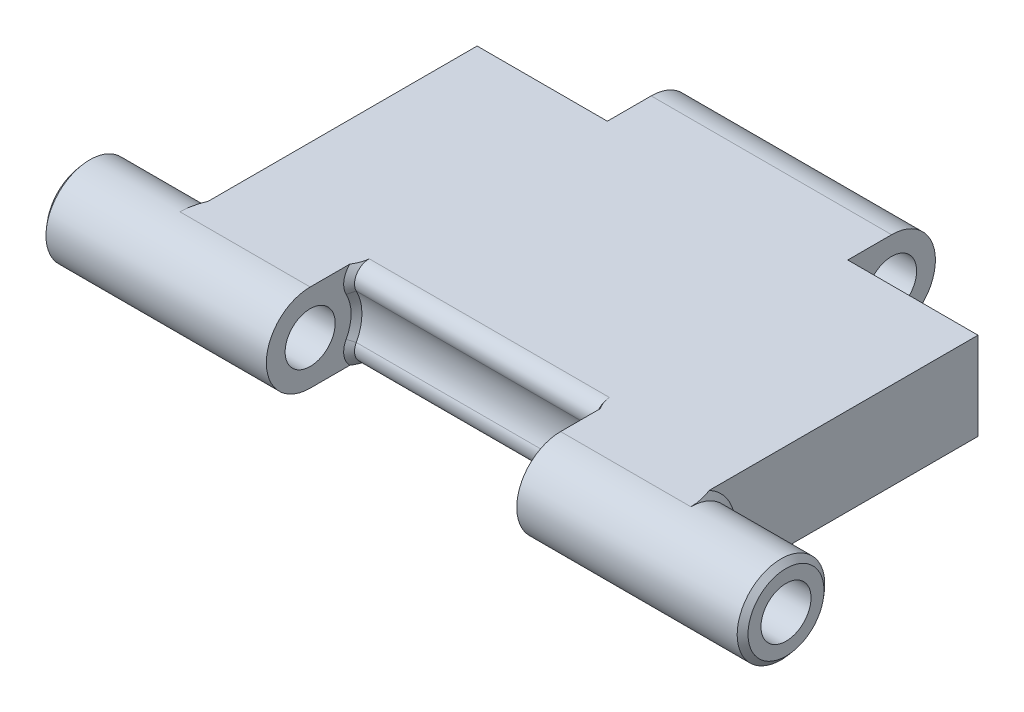
ISO-10303-21;
HEADER;
FILE_DESCRIPTION(('STEP AP214'),'2;1');
FILE_NAME('part.step','',(''),(''),'','','');
FILE_SCHEMA(('AUTOMOTIVE_DESIGN { 1 0 10303 214 1 1 1 1 }'));
ENDSEC;
DATA;
#1=APPLICATION_CONTEXT('core data for automotive mechanical design processes');
#2=APPLICATION_PROTOCOL_DEFINITION('international standard','automotive_design',2000,#1);
#3=PRODUCT_CONTEXT('',#1,'mechanical');
#4=PRODUCT('Part','Part','',(#3));
#5=PRODUCT_RELATED_PRODUCT_CATEGORY('part','',(#4));
#6=PRODUCT_DEFINITION_FORMATION('','',#4);
#7=PRODUCT_DEFINITION_CONTEXT('part definition',#1,'design');
#8=PRODUCT_DEFINITION('design','',#6,#7);
#9=PRODUCT_DEFINITION_SHAPE('','',#8);
#10=(LENGTH_UNIT() NAMED_UNIT(*) SI_UNIT(.MILLI.,.METRE.));
#11=(NAMED_UNIT(*) PLANE_ANGLE_UNIT() SI_UNIT($,.RADIAN.));
#12=(NAMED_UNIT(*) SI_UNIT($,.STERADIAN.) SOLID_ANGLE_UNIT());
#13=UNCERTAINTY_MEASURE_WITH_UNIT(LENGTH_MEASURE(1.E-05),#10,'distance_accuracy_value','');
#14=(GEOMETRIC_REPRESENTATION_CONTEXT(3) GLOBAL_UNCERTAINTY_ASSIGNED_CONTEXT((#13)) GLOBAL_UNIT_ASSIGNED_CONTEXT((#10,
#11,#12)) REPRESENTATION_CONTEXT('',''));
#15=CARTESIAN_POINT('',(0.,0.,0.));
#16=DIRECTION('',(0.,0.,1.));
#17=DIRECTION('',(1.,0.,0.));
#18=AXIS2_PLACEMENT_3D('',#15,#16,#17);
#19=CARTESIAN_POINT('',(-7.5,2.0625,-4.29679665744628));
#20=DIRECTION('',(0.,0.,1.));
#21=DIRECTION('',(1.,0.,0.));
#22=AXIS2_PLACEMENT_3D('',#19,#20,#21);
#23=PLANE('',#22);
#24=DIRECTION('',(0.,-1.,0.));
#25=VECTOR('',#24,1.);
#26=CARTESIAN_POINT('',(3.6,2.0625,-4.29679665744628));
#27=LINE('',#26,#25);
#28=CARTESIAN_POINT('',(3.6,2.0625,-4.29679665744628));
#29=VERTEX_POINT('',#28);
#30=CARTESIAN_POINT('',(3.6,-0.562500000000001,-4.29679665744628));
#31=VERTEX_POINT('',#30);
#32=EDGE_CURVE('E320',#29,#31,#27,.T.);
#33=ORIENTED_EDGE('',*,*,#32,.F.);
#34=DIRECTION('',(-1.,0.,0.));
#35=VECTOR('',#34,1.);
#36=CARTESIAN_POINT('',(-7.5,2.0625,-4.29679665744628));
#37=LINE('',#36,#35);
#38=CARTESIAN_POINT('',(7.50000000000001,2.0625,-4.29679665744628));
#39=VERTEX_POINT('',#38);
#40=EDGE_CURVE('E328',#39,#29,#37,.T.);
#41=ORIENTED_EDGE('',*,*,#40,.F.);
#42=DIRECTION('',(0.,-1.,0.));
#43=VECTOR('',#42,1.);
#44=CARTESIAN_POINT('',(7.50000000000001,2.0625,-4.29679665744628));
#45=LINE('',#44,#43);
#46=CARTESIAN_POINT('',(7.50000000000001,-0.562500000000001,-4.29679665744628));
#47=VERTEX_POINT('',#46);
#48=EDGE_CURVE('E337',#39,#47,#45,.T.);
#49=ORIENTED_EDGE('',*,*,#48,.T.);
#50=DIRECTION('',(-1.,0.,0.));
#51=VECTOR('',#50,1.);
#52=CARTESIAN_POINT('',(-7.5,-0.562500000000001,-4.29679665744628));
#53=LINE('',#52,#51);
#54=EDGE_CURVE('E341',#47,#31,#53,.T.);
#55=ORIENTED_EDGE('',*,*,#54,.T.);
#56=EDGE_LOOP('',(#33,#41,#49,#55));
#57=FACE_BOUND('',#56,.T.);
#58=ADVANCED_FACE('F37',(#57),#23,.F.);
#59=CARTESIAN_POINT('',(0.,2.0625,0.0782033425537235));
#60=DIRECTION('',(0.,1.,0.));
#61=DIRECTION('',(0.,0.,1.));
#62=AXIS2_PLACEMENT_3D('',#59,#60,#61);
#63=PLANE('',#62);
#64=DIRECTION('',(0.,0.,-1.));
#65=VECTOR('',#64,1.);
#66=CARTESIAN_POINT('',(-3.75,2.0625,0.0782033425537235));
#67=LINE('',#66,#65);
#68=CARTESIAN_POINT('',(-3.75,2.0625,4.45320334255372));
#69=VERTEX_POINT('',#68);
#70=CARTESIAN_POINT('',(-3.75,2.0625,3.26607283268659));
#71=VERTEX_POINT('',#70);
#72=EDGE_CURVE('E259',#69,#71,#67,.T.);
#73=ORIENTED_EDGE('',*,*,#72,.T.);
#74=CARTESIAN_POINT('',(-3.75,2.0625,3.26607283268659));
#75=CARTESIAN_POINT('',(-3.73472751691938,2.0625,3.24053395943589));
#76=CARTESIAN_POINT('',(-3.71988106027537,2.0625,3.21469278558408));
#77=CARTESIAN_POINT('',(-3.69156442785183,2.0625,3.16195463874504));
#78=CARTESIAN_POINT('',(-3.6781088066001,2.0625,3.13504992038088));
#79=CARTESIAN_POINT('',(-3.65387520853856,2.0625,3.08123408095706));
#80=CARTESIAN_POINT('',(-3.64301631062911,2.0625,3.05436034990466));
#81=CARTESIAN_POINT('',(-3.62437636089838,2.0625,2.99964098942122));
#82=CARTESIAN_POINT('',(-3.61658254316867,2.0625,2.97179992825206));
#83=CARTESIAN_POINT('',(-3.60736788235844,2.0625,2.92617061808718));
#84=CARTESIAN_POINT('',(-3.60464842548516,2.0625,2.90864678572411));
#85=CARTESIAN_POINT('',(-3.60094355449546,2.0625,2.87322739329477));
#86=CARTESIAN_POINT('',(-3.59997725733482,2.0625,2.85532986285039));
#87=CARTESIAN_POINT('',(-3.59999999999931,2.0625,2.83741212769966));
#88=B_SPLINE_CURVE_WITH_KNOTS('',3,(#74,#75,#76,#77,#78,#79,#80,#81,#82,#83,#84,#85,#86,#87),
.UNSPECIFIED.,.F.,.F.,(4,2,2,2,2,2,4),(0.,0.089330207665187,0.179516586136766,0.266351626059856,
0.352821071838593,0.405939062983331,0.459632864436187),.UNSPECIFIED.);
#89=CARTESIAN_POINT('',(-3.59999999999999,2.0625,2.83741212769953));
#90=VERTEX_POINT('',#89);
#91=EDGE_CURVE('E235',#71,#90,#88,.T.);
#92=ORIENTED_EDGE('',*,*,#91,.T.);
#93=DIRECTION('',(-1.,0.,0.));
#94=VECTOR('',#93,1.);
#95=CARTESIAN_POINT('',(3.75,2.0625,2.83741212769953));
#96=LINE('',#95,#94);
#97=CARTESIAN_POINT('',(3.6,2.0625,2.83741212769953));
#98=VERTEX_POINT('',#97);
#99=EDGE_CURVE('E217',#90,#98,#96,.F.);
#100=ORIENTED_EDGE('',*,*,#99,.T.);
#101=CARTESIAN_POINT('',(3.6,2.0625,2.83741212769953));
#102=CARTESIAN_POINT('',(3.59998598558496,2.0625,2.85287076891136));
#103=CARTESIAN_POINT('',(3.60070203770037,2.0625,2.86832071087352));
#104=CARTESIAN_POINT('',(3.60348290141405,2.0625,2.8990676080709));
#105=CARTESIAN_POINT('',(3.6055448904651,2.0625,2.91436481559499));
#106=CARTESIAN_POINT('',(3.61086650492335,2.0625,2.94450617756884));
#107=CARTESIAN_POINT('',(3.61410752058685,2.0625,2.95935368478284));
#108=CARTESIAN_POINT('',(3.62162944347252,2.0625,2.98878592876527));
#109=CARTESIAN_POINT('',(3.62591081784796,2.0625,3.00337054431811));
#110=CARTESIAN_POINT('',(3.63768570094887,2.0625,3.03941050382392));
#111=CARTESIAN_POINT('',(3.64571952778974,2.0625,3.06068851657887));
#112=CARTESIAN_POINT('',(3.6632496136343,2.0625,3.10264456338908));
#113=CARTESIAN_POINT('',(3.67274736452072,2.0625,3.12332195951883));
#114=CARTESIAN_POINT('',(3.69306241861763,2.0625,3.16464943573229));
#115=CARTESIAN_POINT('',(3.70390659471006,2.0625,3.18528613400107));
#116=CARTESIAN_POINT('',(3.72640786525296,2.0625,3.22603333105834));
#117=CARTESIAN_POINT('',(3.73806243434931,2.0625,3.24614521767035));
#118=CARTESIAN_POINT('',(3.75,2.0625,3.26607283268658));
#119=B_SPLINE_CURVE_WITH_KNOTS('',3,(#101,#102,#103,#104,#105,#106,#107,#108,#109,#110,#111,
#112,#113,#114,#115,#116,#117,#118),.UNSPECIFIED.,.F.,.F.,(4,2,2,2,2,2,2,2,4),(0.,
0.046345443506191,0.0925940074776784,0.138142189045309,0.183710861073522,0.251864569892143,
0.320088198965007,0.390002928340994,0.459708789489418),.UNSPECIFIED.);
#120=CARTESIAN_POINT('',(3.75,2.0625,3.26607283268658));
#121=VERTEX_POINT('',#120);
#122=EDGE_CURVE('E11',#98,#121,#119,.T.);
#123=ORIENTED_EDGE('',*,*,#122,.T.);
#124=DIRECTION('',(0.,0.,-1.));
#125=VECTOR('',#124,1.);
#126=CARTESIAN_POINT('',(3.75,2.0625,0.0782033425537235));
#127=LINE('',#126,#125);
#128=CARTESIAN_POINT('',(3.75,2.0625,4.45320334255372));
#129=VERTEX_POINT('',#128);
#130=EDGE_CURVE('E227',#129,#121,#127,.T.);
#131=ORIENTED_EDGE('',*,*,#130,.F.);
#132=DIRECTION('',(1.,0.,0.));
#133=VECTOR('',#132,1.);
#134=CARTESIAN_POINT('',(-7.49999999999999,2.0625,4.45320334255372));
#135=LINE('',#134,#133);
#136=CARTESIAN_POINT('',(7.65,2.0625,4.45320334255372));
#137=VERTEX_POINT('',#136);
#138=EDGE_CURVE('E163',#129,#137,#135,.T.);
#139=ORIENTED_EDGE('',*,*,#138,.T.);
#140=CARTESIAN_POINT('',(7.65,2.0625,4.45320334255372));
#141=CARTESIAN_POINT('',(7.65004182680005,2.0625,4.40690565201915));
#142=CARTESIAN_POINT('',(7.64790098279406,2.0625,4.36063343311652));
#143=CARTESIAN_POINT('',(7.63958444165527,2.0625,4.2685277521351));
#144=CARTESIAN_POINT('',(7.63341558535607,2.0625,4.22269367961116));
#145=CARTESIAN_POINT('',(7.61746979738847,2.0625,4.13225097953301));
#146=CARTESIAN_POINT('',(7.60773802670418,2.0625,4.08763421726658));
#147=CARTESIAN_POINT('',(7.58514662470327,2.0625,3.99920033076448));
#148=CARTESIAN_POINT('',(7.5722864589786,2.0625,3.95538334452681));
#149=CARTESIAN_POINT('',(7.54937471956883,2.0625,3.8852605242191));
#150=CARTESIAN_POINT('',(7.54013731473035,2.0625,3.85868317596236));
#151=CARTESIAN_POINT('',(7.52073374182946,2.0625,3.80575059493021));
#152=CARTESIAN_POINT('',(7.51056406772099,2.0625,3.77939664488737));
#153=CARTESIAN_POINT('',(7.50000000000002,2.0625,3.75320334255373));
#154=B_SPLINE_CURVE_WITH_KNOTS('',3,(#140,#141,#142,#143,#144,#145,#146,#147,#148,#149,#150,
#151,#152,#153),.UNSPECIFIED.,.F.,.F.,(4,2,2,2,2,2,4),(0.,0.138803058886172,0.277370997445077,
0.41424013900092,0.551132677664967,0.635529054686805,0.720256979095666),.UNSPECIFIED.);
#155=CARTESIAN_POINT('',(7.50000000000001,2.0625,3.75320334255373));
#156=VERTEX_POINT('',#155);
#157=EDGE_CURVE('E307',#137,#156,#154,.T.);
#158=ORIENTED_EDGE('',*,*,#157,.T.);
#159=DIRECTION('',(0.,0.,-1.));
#160=VECTOR('',#159,1.);
#161=CARTESIAN_POINT('',(7.50000000000001,2.0625,-4.29679665744628));
#162=LINE('',#161,#160);
#163=EDGE_CURVE('E192',#156,#39,#162,.T.);
#164=ORIENTED_EDGE('',*,*,#163,.T.);
#165=ORIENTED_EDGE('',*,*,#40,.T.);
#166=DIRECTION('',(0.,0.,1.));
#167=VECTOR('',#166,1.);
#168=CARTESIAN_POINT('',(3.6,2.0625,-5.60929665744627));
#169=LINE('',#168,#167);
#170=CARTESIAN_POINT('',(3.6,2.0625,-5.60929665744627));
#171=VERTEX_POINT('',#170);
#172=EDGE_CURVE('E317',#171,#29,#169,.T.);
#173=ORIENTED_EDGE('',*,*,#172,.F.);
#174=DIRECTION('',(-1.,0.,0.));
#175=VECTOR('',#174,1.);
#176=CARTESIAN_POINT('',(3.6,2.0625,-5.60929665744627));
#177=LINE('',#176,#175);
#178=CARTESIAN_POINT('',(-3.6,2.0625,-5.60929665744627));
#179=VERTEX_POINT('',#178);
#180=EDGE_CURVE('E228',#171,#179,#177,.T.);
#181=ORIENTED_EDGE('',*,*,#180,.T.);
#182=DIRECTION('',(0.,0.,1.));
#183=VECTOR('',#182,1.);
#184=CARTESIAN_POINT('',(-3.6,2.0625,-5.60929665744627));
#185=LINE('',#184,#183);
#186=CARTESIAN_POINT('',(-3.6,2.0625,-4.29679665744628));
#187=VERTEX_POINT('',#186);
#188=EDGE_CURVE('E325',#179,#187,#185,.T.);
#189=ORIENTED_EDGE('',*,*,#188,.T.);
#190=DIRECTION('',(-1.,0.,0.));
#191=VECTOR('',#190,1.);
#192=CARTESIAN_POINT('',(-7.5,2.0625,-4.29679665744628));
#193=LINE('',#192,#191);
#194=CARTESIAN_POINT('',(-7.5,2.0625,-4.29679665744628));
#195=VERTEX_POINT('',#194);
#196=EDGE_CURVE('E316',#187,#195,#193,.T.);
#197=ORIENTED_EDGE('',*,*,#196,.T.);
#198=DIRECTION('',(0.,0.,1.));
#199=VECTOR('',#198,1.);
#200=CARTESIAN_POINT('',(-7.5,2.0625,-4.29679665744628));
#201=LINE('',#200,#199);
#202=CARTESIAN_POINT('',(-7.49999999999999,2.0625,3.75320334255372));
#203=VERTEX_POINT('',#202);
#204=EDGE_CURVE('E282',#195,#203,#201,.T.);
#205=ORIENTED_EDGE('',*,*,#204,.T.);
#206=CARTESIAN_POINT('',(-7.49999999999999,2.0625,3.75320334255372));
#207=CARTESIAN_POINT('',(-7.52251586649166,2.0625,3.80903766150381));
#208=CARTESIAN_POINT('',(-7.54326947360992,2.0625,3.86567251460635));
#209=CARTESIAN_POINT('',(-7.57993834811692,2.0625,3.97988808309137));
#210=CARTESIAN_POINT('',(-7.59589706613527,2.0625,4.03745499156652));
#211=CARTESIAN_POINT('',(-7.62215127651204,2.0625,4.15404248360579));
#212=CARTESIAN_POINT('',(-7.63243564908112,2.0625,4.21306568633319));
#213=CARTESIAN_POINT('',(-7.64289049003036,2.0625,4.30244694472015));
#214=CARTESIAN_POINT('',(-7.64554740008557,2.0625,4.33252672610753));
#215=CARTESIAN_POINT('',(-7.64910565501946,2.0625,4.39280275178858));
#216=CARTESIAN_POINT('',(-7.65000622623105,2.0625,4.42299904153851));
#217=CARTESIAN_POINT('',(-7.64999999999999,2.0625,4.45320334255372));
#218=B_SPLINE_CURVE_WITH_KNOTS('',3,(#206,#207,#208,#209,#210,#211,#212,#213,#214,#215,#216,
#217),.UNSPECIFIED.,.F.,.F.,(4,2,2,2,2,4),(0.,0.180701723227069,0.35971280987811,
0.539073462653036,0.629618297139881,0.720203007616166),.UNSPECIFIED.);
#219=CARTESIAN_POINT('',(-7.64999999999999,2.0625,4.45320334255372));
#220=VERTEX_POINT('',#219);
#221=EDGE_CURVE('E203',#203,#220,#218,.T.);
#222=ORIENTED_EDGE('',*,*,#221,.T.);
#223=DIRECTION('',(1.,0.,0.));
#224=VECTOR('',#223,1.);
#225=CARTESIAN_POINT('',(-7.49999999999999,2.0625,4.45320334255372));
#226=LINE('',#225,#224);
#227=EDGE_CURVE('E208',#220,#69,#226,.T.);
#228=ORIENTED_EDGE('',*,*,#227,.T.);
#229=EDGE_LOOP('',(#73,#92,#100,#123,#131,#139,#158,#164,#165,#173,#181,#189,#197,#205,#222,#228));
#230=FACE_BOUND('',#229,.T.);
#231=ADVANCED_FACE('F284',(#230),#63,.T.);
#232=CARTESIAN_POINT('',(0.,-0.562500000000001,0.0782033425537235));
#233=DIRECTION('',(0.,1.,0.));
#234=DIRECTION('',(0.,0.,1.));
#235=AXIS2_PLACEMENT_3D('',#232,#233,#234);
#236=PLANE('',#235);
#237=DIRECTION('',(0.,0.,-1.));
#238=VECTOR('',#237,1.);
#239=CARTESIAN_POINT('',(3.75,-0.562500000000001,0.0782033425537235));
#240=LINE('',#239,#238);
#241=CARTESIAN_POINT('',(3.75,-0.562500000000001,4.45320334255372));
#242=VERTEX_POINT('',#241);
#243=CARTESIAN_POINT('',(3.75,-0.562500000000001,3.26607283268658));
#244=VERTEX_POINT('',#243);
#245=EDGE_CURVE('E112',#242,#244,#240,.T.);
#246=ORIENTED_EDGE('',*,*,#245,.T.);
#247=CARTESIAN_POINT('',(3.75,-0.562500000000001,3.26607283268658));
#248=CARTESIAN_POINT('',(3.73472751691939,-0.562500000000001,3.24053395943588));
#249=CARTESIAN_POINT('',(3.71988106027537,-0.562500000000001,3.21469278558407));
#250=CARTESIAN_POINT('',(3.69156442785184,-0.562500000000001,3.16195463874503));
#251=CARTESIAN_POINT('',(3.67810880660011,-0.562500000000001,3.13504992038087));
#252=CARTESIAN_POINT('',(3.65387520853856,-0.562500000000001,3.08123408095705));
#253=CARTESIAN_POINT('',(3.64301631062911,-0.562500000000001,3.05436034990465));
#254=CARTESIAN_POINT('',(3.62437636089838,-0.562500000000001,2.99964098942121));
#255=CARTESIAN_POINT('',(3.61658254316867,-0.562500000000001,2.97179992825205));
#256=CARTESIAN_POINT('',(3.60736788235845,-0.562500000000001,2.92617061808717));
#257=CARTESIAN_POINT('',(3.60464842548517,-0.562500000000001,2.9086467857241));
#258=CARTESIAN_POINT('',(3.60094355449547,-0.562500000000001,2.87322739329477));
#259=CARTESIAN_POINT('',(3.59997725733483,-0.562500000000001,2.85532986285039));
#260=CARTESIAN_POINT('',(3.59999999999932,-0.562500000000001,2.83741212769966));
#261=B_SPLINE_CURVE_WITH_KNOTS('',3,(#247,#248,#249,#250,#251,#252,#253,#254,#255,#256,#257,
#258,#259,#260),.UNSPECIFIED.,.F.,.F.,(4,2,2,2,2,2,4),(0.,0.089330207665187,0.179516586136765,
0.266351626059855,0.352821071838591,0.405939062983326,0.459632864436178),.UNSPECIFIED.);
#262=CARTESIAN_POINT('',(3.6,-0.562500000000001,2.83741212769953));
#263=VERTEX_POINT('',#262);
#264=EDGE_CURVE('E47',#244,#263,#261,.T.);
#265=ORIENTED_EDGE('',*,*,#264,.T.);
#266=DIRECTION('',(1.,0.,0.));
#267=VECTOR('',#266,1.);
#268=CARTESIAN_POINT('',(0.,-0.562500000000001,2.83741212769953));
#269=LINE('',#268,#267);
#270=CARTESIAN_POINT('',(-3.59999999999999,-0.562500000000001,2.83741212769953));
#271=VERTEX_POINT('',#270);
#272=EDGE_CURVE('E211',#263,#271,#269,.F.);
#273=ORIENTED_EDGE('',*,*,#272,.T.);
#274=CARTESIAN_POINT('',(-3.59999999999999,-0.562500000000001,2.83741212769953));
#275=CARTESIAN_POINT('',(-3.59998598558495,-0.562500000000001,2.85287076891136));
#276=CARTESIAN_POINT('',(-3.60070203770036,-0.562500000000001,2.86832071087352));
#277=CARTESIAN_POINT('',(-3.60348290141404,-0.562500000000001,2.8990676080709));
#278=CARTESIAN_POINT('',(-3.60554489046509,-0.562500000000001,2.91436481559499));
#279=CARTESIAN_POINT('',(-3.61086650492334,-0.562500000000001,2.94450617756884));
#280=CARTESIAN_POINT('',(-3.61410752058684,-0.562500000000001,2.95935368478284));
#281=CARTESIAN_POINT('',(-3.62162944347251,-0.562500000000001,2.98878592876528));
#282=CARTESIAN_POINT('',(-3.62591081784795,-0.562500000000001,3.00337054431811));
#283=CARTESIAN_POINT('',(-3.63768570094887,-0.562500000000001,3.03941050382392));
#284=CARTESIAN_POINT('',(-3.64571952778974,-0.562500000000001,3.06068851657887));
#285=CARTESIAN_POINT('',(-3.66324961363429,-0.562500000000001,3.10264456338909));
#286=CARTESIAN_POINT('',(-3.67274736452072,-0.562500000000001,3.12332195951884));
#287=CARTESIAN_POINT('',(-3.69306241861762,-0.562500000000001,3.1646494357323));
#288=CARTESIAN_POINT('',(-3.70390659471005,-0.562500000000001,3.18528613400107));
#289=CARTESIAN_POINT('',(-3.72640786525295,-0.562500000000001,3.22603333105835));
#290=CARTESIAN_POINT('',(-3.7380624343493,-0.562500000000001,3.24614521767036));
#291=CARTESIAN_POINT('',(-3.75,-0.562500000000001,3.26607283268659));
#292=B_SPLINE_CURVE_WITH_KNOTS('',3,(#274,#275,#276,#277,#278,#279,#280,#281,#282,#283,#284,
#285,#286,#287,#288,#289,#290,#291),.UNSPECIFIED.,.F.,.F.,(4,2,2,2,2,2,2,2,4),(0.,
0.0463454435061914,0.0925940074776793,0.138142189045311,0.183710861073525,0.251864569892147,
0.320088198965014,0.390002928341001,0.459708789489428),.UNSPECIFIED.);
#293=CARTESIAN_POINT('',(-3.75,-0.562500000000001,3.26607283268659));
#294=VERTEX_POINT('',#293);
#295=EDGE_CURVE('E253',#271,#294,#292,.T.);
#296=ORIENTED_EDGE('',*,*,#295,.T.);
#297=DIRECTION('',(0.,0.,-1.));
#298=VECTOR('',#297,1.);
#299=CARTESIAN_POINT('',(-3.75,-0.562500000000001,0.0782033425537235));
#300=LINE('',#299,#298);
#301=CARTESIAN_POINT('',(-3.75,-0.562500000000001,4.45320334255372));
#302=VERTEX_POINT('',#301);
#303=EDGE_CURVE('E188',#302,#294,#300,.T.);
#304=ORIENTED_EDGE('',*,*,#303,.F.);
#305=DIRECTION('',(1.,0.,0.));
#306=VECTOR('',#305,1.);
#307=CARTESIAN_POINT('',(-7.49999999999999,-0.562500000000001,4.45320334255372));
#308=LINE('',#307,#306);
#309=CARTESIAN_POINT('',(-7.64999999999999,-0.562500000000001,4.45320334255372));
#310=VERTEX_POINT('',#309);
#311=EDGE_CURVE('E181',#310,#302,#308,.T.);
#312=ORIENTED_EDGE('',*,*,#311,.F.);
#313=CARTESIAN_POINT('',(-7.64999999999999,-0.562500000000001,4.45320334255372));
#314=CARTESIAN_POINT('',(-7.65004182680004,-0.562500000000001,4.40690565201915));
#315=CARTESIAN_POINT('',(-7.64790098279405,-0.562500000000001,4.36063343311652));
#316=CARTESIAN_POINT('',(-7.63958444165526,-0.562500000000001,4.2685277521351));
#317=CARTESIAN_POINT('',(-7.63341558535606,-0.562500000000001,4.22269367961116));
#318=CARTESIAN_POINT('',(-7.61746979738845,-0.562500000000001,4.132250979533));
#319=CARTESIAN_POINT('',(-7.60773802670417,-0.562500000000001,4.08763421726658));
#320=CARTESIAN_POINT('',(-7.58514662470326,-0.562500000000001,3.99920033076448));
#321=CARTESIAN_POINT('',(-7.57228645897859,-0.562500000000001,3.9553833445268));
#322=CARTESIAN_POINT('',(-7.54937471956881,-0.562500000000001,3.88526052421909));
#323=CARTESIAN_POINT('',(-7.54013731473033,-0.562500000000001,3.85868317596235));
#324=CARTESIAN_POINT('',(-7.52073374182945,-0.562500000000001,3.8057505949302));
#325=CARTESIAN_POINT('',(-7.51056406772098,-0.562500000000001,3.77939664488736));
#326=CARTESIAN_POINT('',(-7.5,-0.562500000000001,3.75320334255372));
#327=B_SPLINE_CURVE_WITH_KNOTS('',3,(#313,#314,#315,#316,#317,#318,#319,#320,#321,#322,#323,
#324,#325,#326),.UNSPECIFIED.,.F.,.F.,(4,2,2,2,2,2,4),(0.,0.138803058886174,0.277370997445082,
0.414240139000925,0.551132677664973,0.635529054686815,0.720256979095677),.UNSPECIFIED.);
#328=CARTESIAN_POINT('',(-7.49999999999999,-0.562500000000001,3.75320334255372));
#329=VERTEX_POINT('',#328);
#330=EDGE_CURVE('E185',#310,#329,#327,.T.);
#331=ORIENTED_EDGE('',*,*,#330,.T.);
#332=DIRECTION('',(0.,0.,1.));
#333=VECTOR('',#332,1.);
#334=CARTESIAN_POINT('',(-7.5,-0.562500000000001,-4.29679665744628));
#335=LINE('',#334,#333);
#336=CARTESIAN_POINT('',(-7.5,-0.562500000000001,-4.29679665744628));
#337=VERTEX_POINT('',#336);
#338=EDGE_CURVE('E265',#337,#329,#335,.T.);
#339=ORIENTED_EDGE('',*,*,#338,.F.);
#340=DIRECTION('',(-1.,0.,0.));
#341=VECTOR('',#340,1.);
#342=CARTESIAN_POINT('',(-7.5,-0.562500000000001,-4.29679665744628));
#343=LINE('',#342,#341);
#344=CARTESIAN_POINT('',(-3.6,-0.562500000000001,-4.29679665744628));
#345=VERTEX_POINT('',#344);
#346=EDGE_CURVE('E343',#345,#337,#343,.T.);
#347=ORIENTED_EDGE('',*,*,#346,.F.);
#348=DIRECTION('',(0.,0.,-1.));
#349=VECTOR('',#348,1.);
#350=CARTESIAN_POINT('',(-3.6,-0.562500000000001,-4.29679665744628));
#351=LINE('',#350,#349);
#352=CARTESIAN_POINT('',(-3.6,-0.562500000000001,-5.60929665744629));
#353=VERTEX_POINT('',#352);
#354=EDGE_CURVE('E415',#345,#353,#351,.T.);
#355=ORIENTED_EDGE('',*,*,#354,.T.);
#356=DIRECTION('',(-1.,0.,0.));
#357=VECTOR('',#356,1.);
#358=CARTESIAN_POINT('',(3.6,-0.562500000000001,-5.60929665744629));
#359=LINE('',#358,#357);
#360=CARTESIAN_POINT('',(3.6,-0.562500000000001,-5.60929665744629));
#361=VERTEX_POINT('',#360);
#362=EDGE_CURVE('E324',#361,#353,#359,.T.);
#363=ORIENTED_EDGE('',*,*,#362,.F.);
#364=DIRECTION('',(0.,0.,-1.));
#365=VECTOR('',#364,1.);
#366=CARTESIAN_POINT('',(3.6,-0.562500000000001,-4.29679665744628));
#367=LINE('',#366,#365);
#368=EDGE_CURVE('E354',#31,#361,#367,.T.);
#369=ORIENTED_EDGE('',*,*,#368,.F.);
#370=ORIENTED_EDGE('',*,*,#54,.F.);
#371=DIRECTION('',(0.,0.,-1.));
#372=VECTOR('',#371,1.);
#373=CARTESIAN_POINT('',(7.50000000000001,-0.562500000000001,-4.29679665744628));
#374=LINE('',#373,#372);
#375=CARTESIAN_POINT('',(7.50000000000001,-0.562500000000001,3.75320334255373));
#376=VERTEX_POINT('',#375);
#377=EDGE_CURVE('E345',#376,#47,#374,.T.);
#378=ORIENTED_EDGE('',*,*,#377,.F.);
#379=CARTESIAN_POINT('',(7.50000000000001,-0.562500000000001,3.75320334255373));
#380=CARTESIAN_POINT('',(7.52251586649167,-0.562500000000001,3.80903766150382));
#381=CARTESIAN_POINT('',(7.54326947360993,-0.562500000000001,3.86567251460636));
#382=CARTESIAN_POINT('',(7.57993834811693,-0.562500000000001,3.97988808309138));
#383=CARTESIAN_POINT('',(7.59589706613528,-0.562500000000001,4.03745499156653));
#384=CARTESIAN_POINT('',(7.62215127651206,-0.562500000000001,4.15404248360579));
#385=CARTESIAN_POINT('',(7.63243564908113,-0.562500000000001,4.21306568633319));
#386=CARTESIAN_POINT('',(7.64289049003037,-0.562500000000001,4.30244694472015));
#387=CARTESIAN_POINT('',(7.64554740008558,-0.562500000000001,4.33252672610753));
#388=CARTESIAN_POINT('',(7.64910565501946,-0.562500000000001,4.39280275178858));
#389=CARTESIAN_POINT('',(7.65000622623106,-0.562500000000001,4.42299904153851));
#390=CARTESIAN_POINT('',(7.65,-0.562500000000001,4.45320334255372));
#391=B_SPLINE_CURVE_WITH_KNOTS('',3,(#379,#380,#381,#382,#383,#384,#385,#386,#387,#388,#389,
#390),.UNSPECIFIED.,.F.,.F.,(4,2,2,2,2,4),(0.,0.180701723227066,0.359712809878104,
0.539073462653026,0.629618297139869,0.720203007616154),.UNSPECIFIED.);
#392=CARTESIAN_POINT('',(7.65,-0.562500000000001,4.45320334255372));
#393=VERTEX_POINT('',#392);
#394=EDGE_CURVE('E204',#376,#393,#391,.T.);
#395=ORIENTED_EDGE('',*,*,#394,.T.);
#396=DIRECTION('',(1.,0.,0.));
#397=VECTOR('',#396,1.);
#398=CARTESIAN_POINT('',(-7.49999999999999,-0.562500000000001,4.45320334255372));
#399=LINE('',#398,#397);
#400=EDGE_CURVE('E193',#242,#393,#399,.T.);
#401=ORIENTED_EDGE('',*,*,#400,.F.);
#402=EDGE_LOOP('',(#246,#265,#273,#296,#304,#312,#331,#339,#347,#355,#363,#369,#370,#378,#395,#401));
#403=FACE_BOUND('',#402,.T.);
#404=ADVANCED_FACE('F183',(#403),#236,.F.);
#405=CARTESIAN_POINT('',(10.5,0.75,4.45320334255372));
#406=DIRECTION('',(-1.,0.,0.));
#407=DIRECTION('',(0.,0.,1.));
#408=AXIS2_PLACEMENT_3D('',#405,#406,#407);
#409=CYLINDRICAL_SURFACE('',#408,1.3125);
#410=CARTESIAN_POINT('',(-10.35,0.75,4.45320334255372));
#411=DIRECTION('',(1.,0.,0.));
#412=DIRECTION('',(0.,0.,-1.));
#413=AXIS2_PLACEMENT_3D('',#410,#411,#412);
#414=CIRCLE('',#413,1.3125);
#415=CARTESIAN_POINT('',(-10.35,0.75,3.14070334255372));
#416=VERTEX_POINT('',#415);
#417=EDGE_CURVE('E210',#416,#416,#414,.T.);
#418=ORIENTED_EDGE('',*,*,#417,.T.);
#419=EDGE_LOOP('',(#418));
#420=FACE_BOUND('',#419,.T.);
#421=CARTESIAN_POINT('',(-7.64999999999999,0.749999999999999,4.45320334255372));
#422=DIRECTION('',(-1.,0.,0.));
#423=DIRECTION('',(0.,0.,1.));
#424=AXIS2_PLACEMENT_3D('',#421,#422,#423);
#425=CIRCLE('',#424,1.3125);
#426=EDGE_CURVE('E200',#220,#310,#425,.T.);
#427=ORIENTED_EDGE('',*,*,#426,.T.);
#428=ORIENTED_EDGE('',*,*,#311,.T.);
#429=CARTESIAN_POINT('',(-3.75,0.749999999999999,4.45320334255372));
#430=DIRECTION('',(1.,0.,0.));
#431=DIRECTION('',(0.,0.,-1.));
#432=AXIS2_PLACEMENT_3D('',#429,#430,#431);
#433=CIRCLE('',#432,1.3125);
#434=EDGE_CURVE('E221',#69,#302,#433,.T.);
#435=ORIENTED_EDGE('',*,*,#434,.F.);
#436=ORIENTED_EDGE('',*,*,#227,.F.);
#437=EDGE_LOOP('',(#427,#428,#435,#436));
#438=FACE_BOUND('',#437,.T.);
#439=ADVANCED_FACE('F206',(#420,#438),#409,.T.);
#440=CARTESIAN_POINT('',(7.50000000000001,2.0625,-4.29679665744628));
#441=DIRECTION('',(-1.,0.,0.));
#442=DIRECTION('',(0.,0.,1.));
#443=AXIS2_PLACEMENT_3D('',#440,#441,#442);
#444=PLANE('',#443);
#445=ORIENTED_EDGE('',*,*,#163,.F.);
#446=CARTESIAN_POINT('',(7.50000000000001,0.749999999999998,4.45320334255372));
#447=DIRECTION('',(-1.,0.,0.));
#448=DIRECTION('',(0.,0.,1.));
#449=AXIS2_PLACEMENT_3D('',#446,#447,#448);
#450=CIRCLE('',#449,1.4875);
#451=EDGE_CURVE('E154',#156,#376,#450,.T.);
#452=ORIENTED_EDGE('',*,*,#451,.T.);
#453=ORIENTED_EDGE('',*,*,#377,.T.);
#454=ORIENTED_EDGE('',*,*,#48,.F.);
#455=EDGE_LOOP('',(#445,#452,#453,#454));
#456=FACE_BOUND('',#455,.T.);
#457=ADVANCED_FACE('F464',(#456),#444,.F.);
#458=ORIENTED_EDGE('',*,*,#196,.F.);
#459=DIRECTION('',(0.,-1.,0.));
#460=VECTOR('',#459,1.);
#461=CARTESIAN_POINT('',(-3.6,2.0625,-4.29679665744628));
#462=LINE('',#461,#460);
#463=EDGE_CURVE('E102',#187,#345,#462,.T.);
#464=ORIENTED_EDGE('',*,*,#463,.T.);
#465=ORIENTED_EDGE('',*,*,#346,.T.);
#466=DIRECTION('',(0.,-1.,0.));
#467=VECTOR('',#466,1.);
#468=CARTESIAN_POINT('',(-7.5,2.0625,-4.29679665744628));
#469=LINE('',#468,#467);
#470=EDGE_CURVE('E340',#195,#337,#469,.T.);
#471=ORIENTED_EDGE('',*,*,#470,.F.);
#472=EDGE_LOOP('',(#458,#464,#465,#471));
#473=FACE_BOUND('',#472,.T.);
#474=ADVANCED_FACE('F459',(#473),#23,.F.);
#475=CARTESIAN_POINT('',(-7.5,2.0625,-4.29679665744628));
#476=DIRECTION('',(1.,0.,0.));
#477=DIRECTION('',(0.,0.,-1.));
#478=AXIS2_PLACEMENT_3D('',#475,#476,#477);
#479=PLANE('',#478);
#480=ORIENTED_EDGE('',*,*,#338,.T.);
#481=CARTESIAN_POINT('',(-7.49999999999999,0.75,4.45320334255372));
#482=DIRECTION('',(1.,0.,0.));
#483=DIRECTION('',(0.,0.,-1.));
#484=AXIS2_PLACEMENT_3D('',#481,#482,#483);
#485=CIRCLE('',#484,1.4875);
#486=EDGE_CURVE('E202',#329,#203,#485,.T.);
#487=ORIENTED_EDGE('',*,*,#486,.T.);
#488=ORIENTED_EDGE('',*,*,#204,.F.);
#489=ORIENTED_EDGE('',*,*,#470,.T.);
#490=EDGE_LOOP('',(#480,#487,#488,#489));
#491=FACE_BOUND('',#490,.T.);
#492=ADVANCED_FACE('F463',(#491),#479,.F.);
#493=CARTESIAN_POINT('',(10.35,0.75,4.45320334255372));
#494=DIRECTION('',(-1.,0.,0.));
#495=DIRECTION('',(0.,0.,1.));
#496=AXIS2_PLACEMENT_3D('',#493,#494,#495);
#497=CIRCLE('',#496,1.3125);
#498=CARTESIAN_POINT('',(10.35,0.75,5.76570334255372));
#499=VERTEX_POINT('',#498);
#500=EDGE_CURVE('E364',#499,#499,#497,.T.);
#501=ORIENTED_EDGE('',*,*,#500,.T.);
#502=EDGE_LOOP('',(#501));
#503=FACE_BOUND('',#502,.T.);
#504=CARTESIAN_POINT('',(7.65,0.749999999999999,4.45320334255372));
#505=DIRECTION('',(1.,0.,0.));
#506=DIRECTION('',(0.,0.,-1.));
#507=AXIS2_PLACEMENT_3D('',#504,#505,#506);
#508=CIRCLE('',#507,1.3125);
#509=EDGE_CURVE('E365',#393,#137,#508,.T.);
#510=ORIENTED_EDGE('',*,*,#509,.T.);
#511=ORIENTED_EDGE('',*,*,#138,.F.);
#512=CARTESIAN_POINT('',(3.75,0.749999999999999,4.45320334255372));
#513=DIRECTION('',(1.,0.,0.));
#514=DIRECTION('',(0.,0.,-1.));
#515=AXIS2_PLACEMENT_3D('',#512,#513,#514);
#516=CIRCLE('',#515,1.3125);
#517=EDGE_CURVE('E225',#129,#242,#516,.T.);
#518=ORIENTED_EDGE('',*,*,#517,.T.);
#519=ORIENTED_EDGE('',*,*,#400,.T.);
#520=EDGE_LOOP('',(#510,#511,#518,#519));
#521=FACE_BOUND('',#520,.T.);
#522=ADVANCED_FACE('F469',(#503,#521),#409,.T.);
#523=CARTESIAN_POINT('',(10.5,0.749999999999999,4.45320334255372));
#524=DIRECTION('',(1.,0.,0.));
#525=DIRECTION('',(0.,0.,-1.));
#526=AXIS2_PLACEMENT_3D('',#523,#524,#525);
#527=PLANE('',#526);
#528=CARTESIAN_POINT('',(10.5,0.75,4.45320334255372));
#529=DIRECTION('',(1.,0.,0.));
#530=DIRECTION('',(0.,0.,-1.));
#531=AXIS2_PLACEMENT_3D('',#528,#529,#530);
#532=CIRCLE('',#531,0.75);
#533=CARTESIAN_POINT('',(10.5,0.75,3.70320334255372));
#534=VERTEX_POINT('',#533);
#535=EDGE_CURVE('E433',#534,#534,#532,.T.);
#536=ORIENTED_EDGE('',*,*,#535,.F.);
#537=EDGE_LOOP('',(#536));
#538=FACE_BOUND('',#537,.T.);
#539=CARTESIAN_POINT('',(10.5,0.75,4.45320334255372));
#540=DIRECTION('',(1.,0.,0.));
#541=DIRECTION('',(0.,0.,-1.));
#542=AXIS2_PLACEMENT_3D('',#539,#540,#541);
#543=CIRCLE('',#542,1.13750000000001);
#544=CARTESIAN_POINT('',(10.5,0.75,3.31570334255372));
#545=VERTEX_POINT('',#544);
#546=EDGE_CURVE('E368',#545,#545,#543,.T.);
#547=ORIENTED_EDGE('',*,*,#546,.T.);
#548=EDGE_LOOP('',(#547));
#549=FACE_BOUND('',#548,.T.);
#550=ADVANCED_FACE('F669',(#538,#549),#527,.T.);
#551=CARTESIAN_POINT('',(-10.5,0.749999999999999,4.45320334255372));
#552=DIRECTION('',(1.,0.,0.));
#553=DIRECTION('',(0.,0.,-1.));
#554=AXIS2_PLACEMENT_3D('',#551,#552,#553);
#555=PLANE('',#554);
#556=CARTESIAN_POINT('',(-10.5,0.75,4.45320334255372));
#557=DIRECTION('',(1.,0.,0.));
#558=DIRECTION('',(0.,0.,-1.));
#559=AXIS2_PLACEMENT_3D('',#556,#557,#558);
#560=CIRCLE('',#559,0.75);
#561=CARTESIAN_POINT('',(-10.5,0.75,3.70320334255372));
#562=VERTEX_POINT('',#561);
#563=EDGE_CURVE('E427',#562,#562,#560,.F.);
#564=ORIENTED_EDGE('',*,*,#563,.F.);
#565=EDGE_LOOP('',(#564));
#566=FACE_BOUND('',#565,.T.);
#567=CARTESIAN_POINT('',(-10.5,0.75,4.45320334255372));
#568=DIRECTION('',(-1.,0.,0.));
#569=DIRECTION('',(0.,-1.,0.));
#570=AXIS2_PLACEMENT_3D('',#567,#568,#569);
#571=CIRCLE('',#570,1.1375);
#572=CARTESIAN_POINT('',(-10.5,-0.3875,4.45320334255372));
#573=VERTEX_POINT('',#572);
#574=EDGE_CURVE('E214',#573,#573,#571,.T.);
#575=ORIENTED_EDGE('',*,*,#574,.T.);
#576=EDGE_LOOP('',(#575));
#577=FACE_BOUND('',#576,.T.);
#578=ADVANCED_FACE('F657',(#566,#577),#555,.F.);
#579=CARTESIAN_POINT('',(-3.75,0.75,4.45320334255372));
#580=DIRECTION('',(1.,0.,0.));
#581=DIRECTION('',(0.,0.,-1.));
#582=AXIS2_PLACEMENT_3D('',#579,#580,#581);
#583=CYLINDRICAL_SURFACE('',#582,1.4);
#584=DIRECTION('',(1.,0.,0.));
#585=VECTOR('',#584,1.);
#586=CARTESIAN_POINT('',(-3.75,1.41666666666667,3.22212432171243));
#587=LINE('',#586,#585);
#588=CARTESIAN_POINT('',(3.6,1.41666666666667,3.22212432171243));
#589=VERTEX_POINT('',#588);
#590=CARTESIAN_POINT('',(-3.59999999999999,1.41666666666667,3.22212432171243));
#591=VERTEX_POINT('',#590);
#592=EDGE_CURVE('E386',#589,#591,#587,.F.);
#593=ORIENTED_EDGE('',*,*,#592,.T.);
#594=CARTESIAN_POINT('',(-3.59999999999999,0.75,4.45320334255372));
#595=DIRECTION('',(-1.,0.,0.));
#596=DIRECTION('',(0.,0.,1.));
#597=AXIS2_PLACEMENT_3D('',#594,#595,#596);
#598=CIRCLE('',#597,1.4);
#599=CARTESIAN_POINT('',(-3.59999999999999,0.0833333333333328,3.22212432171243));
#600=VERTEX_POINT('',#599);
#601=EDGE_CURVE('E374',#591,#600,#598,.T.);
#602=ORIENTED_EDGE('',*,*,#601,.T.);
#603=DIRECTION('',(1.,0.,0.));
#604=VECTOR('',#603,1.);
#605=CARTESIAN_POINT('',(-3.75,0.0833333333333328,3.22212432171243));
#606=LINE('',#605,#604);
#607=CARTESIAN_POINT('',(3.6,0.0833333333333328,3.22212432171243));
#608=VERTEX_POINT('',#607);
#609=EDGE_CURVE('E224',#600,#608,#606,.T.);
#610=ORIENTED_EDGE('',*,*,#609,.T.);
#611=CARTESIAN_POINT('',(3.6,0.75,4.45320334255372));
#612=DIRECTION('',(1.,0.,0.));
#613=DIRECTION('',(0.,0.,-1.));
#614=AXIS2_PLACEMENT_3D('',#611,#612,#613);
#615=CIRCLE('',#614,1.4);
#616=EDGE_CURVE('E390',#608,#589,#615,.T.);
#617=ORIENTED_EDGE('',*,*,#616,.T.);
#618=EDGE_LOOP('',(#593,#602,#610,#617));
#619=FACE_BOUND('',#618,.T.);
#620=ADVANCED_FACE('F539',(#619),#583,.F.);
#621=CARTESIAN_POINT('',(-3.75,0.749999999999999,4.45320334255372));
#622=DIRECTION('',(1.,0.,0.));
#623=DIRECTION('',(0.,0.,-1.));
#624=AXIS2_PLACEMENT_3D('',#621,#622,#623);
#625=PLANE('',#624);
#626=CARTESIAN_POINT('',(-3.75,0.75,4.45320334255372));
#627=DIRECTION('',(1.,0.,0.));
#628=DIRECTION('',(0.,0.,-1.));
#629=AXIS2_PLACEMENT_3D('',#626,#627,#628);
#630=CIRCLE('',#629,0.75);
#631=CARTESIAN_POINT('',(-3.75,0.75,3.70320334255372));
#632=VERTEX_POINT('',#631);
#633=EDGE_CURVE('E411',#632,#632,#630,.T.);
#634=ORIENTED_EDGE('',*,*,#633,.F.);
#635=EDGE_LOOP('',(#634));
#636=FACE_BOUND('',#635,.T.);
#637=ORIENTED_EDGE('',*,*,#303,.T.);
#638=CARTESIAN_POINT('',(-3.74999999999999,-0.125000000000001,2.83741212769953));
#639=DIRECTION('',(-1.,0.,0.));
#640=DIRECTION('',(0.,0.,1.));
#641=AXIS2_PLACEMENT_3D('',#638,#639,#640);
#642=CIRCLE('',#641,0.612500000000006);
#643=CARTESIAN_POINT('',(-3.75,0.16666666666667,3.3760091993176));
#644=VERTEX_POINT('',#643);
#645=EDGE_CURVE('E397',#294,#644,#642,.T.);
#646=ORIENTED_EDGE('',*,*,#645,.T.);
#647=CARTESIAN_POINT('',(-3.74999999999999,0.749999999999999,4.45320334255372));
#648=DIRECTION('',(1.,0.,0.));
#649=DIRECTION('',(0.,0.,-1.));
#650=AXIS2_PLACEMENT_3D('',#647,#648,#649);
#651=CIRCLE('',#650,1.22499999999999);
#652=CARTESIAN_POINT('',(-3.75,1.33333333333333,3.3760091993176));
#653=VERTEX_POINT('',#652);
#654=EDGE_CURVE('E398',#644,#653,#651,.T.);
#655=ORIENTED_EDGE('',*,*,#654,.T.);
#656=CARTESIAN_POINT('',(-3.75,1.625,2.83741212769953));
#657=DIRECTION('',(-1.,0.,0.));
#658=DIRECTION('',(0.,0.,1.));
#659=AXIS2_PLACEMENT_3D('',#656,#657,#658);
#660=CIRCLE('',#659,0.612500000000007);
#661=EDGE_CURVE('E395',#653,#71,#660,.T.);
#662=ORIENTED_EDGE('',*,*,#661,.T.);
#663=ORIENTED_EDGE('',*,*,#72,.F.);
#664=ORIENTED_EDGE('',*,*,#434,.T.);
#665=EDGE_LOOP('',(#637,#646,#655,#662,#663,#664));
#666=FACE_BOUND('',#665,.T.);
#667=ADVANCED_FACE('F518',(#636,#666),#625,.T.);
#668=CARTESIAN_POINT('',(3.75,0.749999999999999,4.45320334255372));
#669=DIRECTION('',(1.,0.,0.));
#670=DIRECTION('',(0.,0.,-1.));
#671=AXIS2_PLACEMENT_3D('',#668,#669,#670);
#672=PLANE('',#671);
#673=CARTESIAN_POINT('',(3.75,0.75,4.45320334255372));
#674=DIRECTION('',(1.,0.,0.));
#675=DIRECTION('',(0.,0.,-1.));
#676=AXIS2_PLACEMENT_3D('',#673,#674,#675);
#677=CIRCLE('',#676,0.75);
#678=CARTESIAN_POINT('',(3.75,0.75,3.70320334255372));
#679=VERTEX_POINT('',#678);
#680=EDGE_CURVE('E41',#679,#679,#677,.T.);
#681=ORIENTED_EDGE('',*,*,#680,.T.);
#682=EDGE_LOOP('',(#681));
#683=FACE_BOUND('',#682,.T.);
#684=CARTESIAN_POINT('',(3.75,0.749999999999999,4.45320334255372));
#685=DIRECTION('',(-1.,0.,0.));
#686=DIRECTION('',(0.,0.,1.));
#687=AXIS2_PLACEMENT_3D('',#684,#685,#686);
#688=CIRCLE('',#687,1.225);
#689=CARTESIAN_POINT('',(3.75,1.33333333333333,3.37600919931759));
#690=VERTEX_POINT('',#689);
#691=CARTESIAN_POINT('',(3.75,0.166666666666667,3.37600919931759));
#692=VERTEX_POINT('',#691);
#693=EDGE_CURVE('E56',#690,#692,#688,.T.);
#694=ORIENTED_EDGE('',*,*,#693,.T.);
#695=CARTESIAN_POINT('',(3.75,-0.125000000000001,2.83741212769953));
#696=DIRECTION('',(1.,0.,0.));
#697=DIRECTION('',(0.,0.,-1.));
#698=AXIS2_PLACEMENT_3D('',#695,#696,#697);
#699=CIRCLE('',#698,0.6125);
#700=EDGE_CURVE('E314',#692,#244,#699,.T.);
#701=ORIENTED_EDGE('',*,*,#700,.T.);
#702=ORIENTED_EDGE('',*,*,#245,.F.);
#703=ORIENTED_EDGE('',*,*,#517,.F.);
#704=ORIENTED_EDGE('',*,*,#130,.T.);
#705=CARTESIAN_POINT('',(3.75,1.625,2.83741212769953));
#706=DIRECTION('',(1.,0.,0.));
#707=DIRECTION('',(0.,0.,-1.));
#708=AXIS2_PLACEMENT_3D('',#705,#706,#707);
#709=CIRCLE('',#708,0.6125);
#710=EDGE_CURVE('E373',#121,#690,#709,.T.);
#711=ORIENTED_EDGE('',*,*,#710,.T.);
#712=EDGE_LOOP('',(#694,#701,#702,#703,#704,#711));
#713=FACE_BOUND('',#712,.T.);
#714=ADVANCED_FACE('F445',(#683,#713),#672,.F.);
#715=CARTESIAN_POINT('',(-3.75,1.625,2.83741212769953));
#716=DIRECTION('',(1.,0.,0.));
#717=DIRECTION('',(0.,0.,-1.));
#718=AXIS2_PLACEMENT_3D('',#715,#716,#717);
#719=CYLINDRICAL_SURFACE('',#718,0.4375);
#720=ORIENTED_EDGE('',*,*,#99,.F.);
#721=CARTESIAN_POINT('',(-3.59999999999999,1.625,2.83741212769953));
#722=DIRECTION('',(1.,0.,0.));
#723=DIRECTION('',(0.,0.,-1.));
#724=AXIS2_PLACEMENT_3D('',#721,#722,#723);
#725=CIRCLE('',#724,0.4375);
#726=EDGE_CURVE('E379',#90,#591,#725,.T.);
#727=ORIENTED_EDGE('',*,*,#726,.T.);
#728=ORIENTED_EDGE('',*,*,#592,.F.);
#729=CARTESIAN_POINT('',(3.6,1.625,2.83741212769953));
#730=DIRECTION('',(-1.,0.,0.));
#731=DIRECTION('',(0.,0.,1.));
#732=AXIS2_PLACEMENT_3D('',#729,#730,#731);
#733=CIRCLE('',#732,0.4375);
#734=EDGE_CURVE('E377',#589,#98,#733,.T.);
#735=ORIENTED_EDGE('',*,*,#734,.T.);
#736=EDGE_LOOP('',(#720,#727,#728,#735));
#737=FACE_BOUND('',#736,.T.);
#738=ADVANCED_FACE('F531',(#737),#719,.T.);
#739=CARTESIAN_POINT('',(-3.75,-0.125000000000001,2.83741212769953));
#740=DIRECTION('',(1.,0.,0.));
#741=DIRECTION('',(0.,0.,-1.));
#742=AXIS2_PLACEMENT_3D('',#739,#740,#741);
#743=CYLINDRICAL_SURFACE('',#742,0.4375);
#744=ORIENTED_EDGE('',*,*,#609,.F.);
#745=CARTESIAN_POINT('',(-3.59999999999999,-0.125000000000001,2.83741212769953));
#746=DIRECTION('',(1.,0.,0.));
#747=DIRECTION('',(0.,0.,-1.));
#748=AXIS2_PLACEMENT_3D('',#745,#746,#747);
#749=CIRCLE('',#748,0.4375);
#750=EDGE_CURVE('E380',#600,#271,#749,.T.);
#751=ORIENTED_EDGE('',*,*,#750,.T.);
#752=ORIENTED_EDGE('',*,*,#272,.F.);
#753=CARTESIAN_POINT('',(3.6,-0.125000000000001,2.83741212769953));
#754=DIRECTION('',(-1.,0.,0.));
#755=DIRECTION('',(0.,0.,1.));
#756=AXIS2_PLACEMENT_3D('',#753,#754,#755);
#757=CIRCLE('',#756,0.4375);
#758=EDGE_CURVE('E404',#263,#608,#757,.T.);
#759=ORIENTED_EDGE('',*,*,#758,.T.);
#760=EDGE_LOOP('',(#744,#751,#752,#759));
#761=FACE_BOUND('',#760,.T.);
#762=ADVANCED_FACE('F526',(#761),#743,.T.);
#763=CARTESIAN_POINT('',(3.6,0.749999999999999,-5.60929665744628));
#764=DIRECTION('',(1.,0.,0.));
#765=DIRECTION('',(0.,0.,-1.));
#766=AXIS2_PLACEMENT_3D('',#763,#764,#765);
#767=PLANE('',#766);
#768=CARTESIAN_POINT('',(3.6,0.749999999999999,-5.60929665744628));
#769=DIRECTION('',(1.,0.,0.));
#770=DIRECTION('',(0.,0.,-1.));
#771=AXIS2_PLACEMENT_3D('',#768,#769,#770);
#772=CIRCLE('',#771,0.75);
#773=CARTESIAN_POINT('',(3.6,0.749999999999999,-6.35929665744628));
#774=VERTEX_POINT('',#773);
#775=EDGE_CURVE('E426',#774,#774,#772,.T.);
#776=ORIENTED_EDGE('',*,*,#775,.F.);
#777=EDGE_LOOP('',(#776));
#778=FACE_BOUND('',#777,.T.);
#779=CARTESIAN_POINT('',(3.6,0.749999999999999,-5.60929665744628));
#780=DIRECTION('',(1.,0.,0.));
#781=DIRECTION('',(0.,0.,-1.));
#782=AXIS2_PLACEMENT_3D('',#779,#780,#781);
#783=CIRCLE('',#782,1.3125);
#784=EDGE_CURVE('E321',#361,#171,#783,.T.);
#785=ORIENTED_EDGE('',*,*,#784,.T.);
#786=ORIENTED_EDGE('',*,*,#172,.T.);
#787=ORIENTED_EDGE('',*,*,#32,.T.);
#788=ORIENTED_EDGE('',*,*,#368,.T.);
#789=EDGE_LOOP('',(#785,#786,#787,#788));
#790=FACE_BOUND('',#789,.T.);
#791=ADVANCED_FACE('F487',(#778,#790),#767,.T.);
#792=CARTESIAN_POINT('',(-3.6,0.749999999999999,-5.60929665744628));
#793=DIRECTION('',(1.,0.,0.));
#794=DIRECTION('',(0.,0.,-1.));
#795=AXIS2_PLACEMENT_3D('',#792,#793,#794);
#796=PLANE('',#795);
#797=CARTESIAN_POINT('',(-3.6,0.749999999999999,-5.60929665744628));
#798=DIRECTION('',(1.,0.,0.));
#799=DIRECTION('',(0.,0.,-1.));
#800=AXIS2_PLACEMENT_3D('',#797,#798,#799);
#801=CIRCLE('',#800,0.75);
#802=CARTESIAN_POINT('',(-3.6,0.749999999999999,-6.35929665744628));
#803=VERTEX_POINT('',#802);
#804=EDGE_CURVE('E424',#803,#803,#801,.T.);
#805=ORIENTED_EDGE('',*,*,#804,.T.);
#806=EDGE_LOOP('',(#805));
#807=FACE_BOUND('',#806,.T.);
#808=CARTESIAN_POINT('',(-3.6,0.749999999999999,-5.60929665744628));
#809=DIRECTION('',(1.,0.,0.));
#810=DIRECTION('',(0.,0.,-1.));
#811=AXIS2_PLACEMENT_3D('',#808,#809,#810);
#812=CIRCLE('',#811,1.3125);
#813=EDGE_CURVE('E327',#353,#179,#812,.T.);
#814=ORIENTED_EDGE('',*,*,#813,.F.);
#815=ORIENTED_EDGE('',*,*,#354,.F.);
#816=ORIENTED_EDGE('',*,*,#463,.F.);
#817=ORIENTED_EDGE('',*,*,#188,.F.);
#818=EDGE_LOOP('',(#814,#815,#816,#817));
#819=FACE_BOUND('',#818,.T.);
#820=ADVANCED_FACE('F478',(#807,#819),#796,.F.);
#821=CARTESIAN_POINT('',(3.6,0.75,-5.60929665744628));
#822=DIRECTION('',(-1.,0.,0.));
#823=DIRECTION('',(0.,-1.,0.));
#824=AXIS2_PLACEMENT_3D('',#821,#822,#823);
#825=CYLINDRICAL_SURFACE('',#824,1.3125);
#826=ORIENTED_EDGE('',*,*,#813,.T.);
#827=ORIENTED_EDGE('',*,*,#180,.F.);
#828=ORIENTED_EDGE('',*,*,#784,.F.);
#829=ORIENTED_EDGE('',*,*,#362,.T.);
#830=EDGE_LOOP('',(#826,#827,#828,#829));
#831=FACE_BOUND('',#830,.T.);
#832=ADVANCED_FACE('F489',(#831),#825,.T.);
#833=CARTESIAN_POINT('',(-10.35,0.749999999999999,4.45320334255372));
#834=DIRECTION('',(1.,0.,0.));
#835=DIRECTION('',(0.,1.,0.));
#836=AXIS2_PLACEMENT_3D('',#833,#834,#835);
#837=CONICAL_SURFACE('',#836,1.3125,0.862170054667221);
#838=ORIENTED_EDGE('',*,*,#574,.F.);
#839=EDGE_LOOP('',(#838));
#840=FACE_BOUND('',#839,.T.);
#841=ORIENTED_EDGE('',*,*,#417,.F.);
#842=EDGE_LOOP('',(#841));
#843=FACE_BOUND('',#842,.T.);
#844=ADVANCED_FACE('F491',(#840,#843),#837,.T.);
#845=CARTESIAN_POINT('',(10.35,0.749999999999999,4.45320334255372));
#846=DIRECTION('',(-1.,0.,0.));
#847=DIRECTION('',(0.,-1.,0.));
#848=AXIS2_PLACEMENT_3D('',#845,#846,#847);
#849=CONICAL_SURFACE('',#848,1.3125,0.862170054667222);
#850=ORIENTED_EDGE('',*,*,#500,.F.);
#851=EDGE_LOOP('',(#850));
#852=FACE_BOUND('',#851,.T.);
#853=ORIENTED_EDGE('',*,*,#546,.F.);
#854=EDGE_LOOP('',(#853));
#855=FACE_BOUND('',#854,.T.);
#856=ADVANCED_FACE('F497',(#852,#855),#849,.T.);
#857=CARTESIAN_POINT('',(7.50000000000001,0.749999999999999,4.45320334255372));
#858=DIRECTION('',(-1.,0.,0.));
#859=DIRECTION('',(0.,0.,1.));
#860=AXIS2_PLACEMENT_3D('',#857,#858,#859);
#861=CONICAL_SURFACE('',#860,1.4875,0.862170054667219);
#862=ORIENTED_EDGE('',*,*,#394,.F.);
#863=ORIENTED_EDGE('',*,*,#451,.F.);
#864=ORIENTED_EDGE('',*,*,#157,.F.);
#865=ORIENTED_EDGE('',*,*,#509,.F.);
#866=EDGE_LOOP('',(#862,#863,#864,#865));
#867=FACE_BOUND('',#866,.T.);
#868=ADVANCED_FACE('F271',(#867),#861,.T.);
#869=CARTESIAN_POINT('',(-7.4999999999999,0.749999999999999,4.45320334255372));
#870=DIRECTION('',(1.,0.,0.));
#871=DIRECTION('',(0.,0.,-1.));
#872=AXIS2_PLACEMENT_3D('',#869,#870,#871);
#873=CONICAL_SURFACE('',#872,1.48750000000011,0.862170054667227);
#874=ORIENTED_EDGE('',*,*,#221,.F.);
#875=ORIENTED_EDGE('',*,*,#486,.F.);
#876=ORIENTED_EDGE('',*,*,#330,.F.);
#877=ORIENTED_EDGE('',*,*,#426,.F.);
#878=EDGE_LOOP('',(#874,#875,#876,#877));
#879=FACE_BOUND('',#878,.T.);
#880=ADVANCED_FACE('F199',(#879),#873,.T.);
#881=CARTESIAN_POINT('',(-3.75,1.625,2.83741212769953));
#882=DIRECTION('',(-1.,0.,0.));
#883=DIRECTION('',(0.,-1.,0.));
#884=AXIS2_PLACEMENT_3D('',#881,#882,#883);
#885=CONICAL_SURFACE('',#884,0.612500000000008,0.862170054667231);
#886=ORIENTED_EDGE('',*,*,#91,.F.);
#887=ORIENTED_EDGE('',*,*,#661,.F.);
#888=DIRECTION('',(-0.650791373455965,-0.361550763031096,0.667646339005113));
#889=VECTOR('',#888,1.);
#890=CARTESIAN_POINT('',(-3.59999999999999,1.41666666666667,3.22212432171243));
#891=LINE('',#890,#889);
#892=EDGE_CURVE('E399',#591,#653,#891,.T.);
#893=ORIENTED_EDGE('',*,*,#892,.F.);
#894=ORIENTED_EDGE('',*,*,#726,.F.);
#895=EDGE_LOOP('',(#886,#887,#893,#894));
#896=FACE_BOUND('',#895,.T.);
#897=ADVANCED_FACE('F270',(#896),#885,.T.);
#898=CARTESIAN_POINT('',(-3.59999999999999,0.749999999999999,4.45320334255372));
#899=DIRECTION('',(1.,0.,0.));
#900=DIRECTION('',(0.,1.,0.));
#901=AXIS2_PLACEMENT_3D('',#898,#899,#900);
#902=CONICAL_SURFACE('',#901,1.4,0.862170054667232);
#903=ORIENTED_EDGE('',*,*,#892,.T.);
#904=ORIENTED_EDGE('',*,*,#654,.F.);
#905=DIRECTION('',(-0.650791373455965,0.361550763031095,0.667646339005113));
#906=VECTOR('',#905,1.);
#907=CARTESIAN_POINT('',(-3.59999999999999,0.0833333333333328,3.22212432171243));
#908=LINE('',#907,#906);
#909=EDGE_CURVE('E384',#600,#644,#908,.T.);
#910=ORIENTED_EDGE('',*,*,#909,.F.);
#911=ORIENTED_EDGE('',*,*,#601,.F.);
#912=EDGE_LOOP('',(#903,#904,#910,#911));
#913=FACE_BOUND('',#912,.T.);
#914=ADVANCED_FACE('F250',(#913),#902,.F.);
#915=CARTESIAN_POINT('',(-3.75,-0.125000000000001,2.83741212769953));
#916=DIRECTION('',(-1.,0.,0.));
#917=DIRECTION('',(0.,-1.,0.));
#918=AXIS2_PLACEMENT_3D('',#915,#916,#917);
#919=CONICAL_SURFACE('',#918,0.612500000000008,0.862170054667231);
#920=ORIENTED_EDGE('',*,*,#295,.F.);
#921=ORIENTED_EDGE('',*,*,#750,.F.);
#922=ORIENTED_EDGE('',*,*,#909,.T.);
#923=ORIENTED_EDGE('',*,*,#645,.F.);
#924=EDGE_LOOP('',(#920,#921,#922,#923));
#925=FACE_BOUND('',#924,.T.);
#926=ADVANCED_FACE('F245',(#925),#919,.T.);
#927=CARTESIAN_POINT('',(3.75,1.625,2.83741212769953));
#928=DIRECTION('',(1.,0.,0.));
#929=DIRECTION('',(0.,0.,-1.));
#930=AXIS2_PLACEMENT_3D('',#927,#928,#929);
#931=CONICAL_SURFACE('',#930,0.612500000000001,0.862170054667222);
#932=ORIENTED_EDGE('',*,*,#122,.F.);
#933=ORIENTED_EDGE('',*,*,#734,.F.);
#934=DIRECTION('',(-0.650791373455973,0.361550763031092,-0.667646339005107));
#935=VECTOR('',#934,1.);
#936=CARTESIAN_POINT('',(3.75,1.33333333333333,3.37600919931759));
#937=LINE('',#936,#935);
#938=EDGE_CURVE('E381',#690,#589,#937,.T.);
#939=ORIENTED_EDGE('',*,*,#938,.F.);
#940=ORIENTED_EDGE('',*,*,#710,.F.);
#941=EDGE_LOOP('',(#932,#933,#939,#940));
#942=FACE_BOUND('',#941,.T.);
#943=ADVANCED_FACE('F249',(#942),#931,.T.);
#944=CARTESIAN_POINT('',(3.6,0.749999999999999,4.45320334255372));
#945=DIRECTION('',(-1.,0.,0.));
#946=DIRECTION('',(0.,-1.,0.));
#947=AXIS2_PLACEMENT_3D('',#944,#945,#946);
#948=CONICAL_SURFACE('',#947,1.4,0.86217005466722);
#949=ORIENTED_EDGE('',*,*,#938,.T.);
#950=ORIENTED_EDGE('',*,*,#616,.F.);
#951=DIRECTION('',(-0.650791373455973,-0.361550763031091,-0.667646339005108));
#952=VECTOR('',#951,1.);
#953=CARTESIAN_POINT('',(3.75,0.166666666666667,3.37600919931759));
#954=LINE('',#953,#952);
#955=EDGE_CURVE('E385',#692,#608,#954,.T.);
#956=ORIENTED_EDGE('',*,*,#955,.F.);
#957=ORIENTED_EDGE('',*,*,#693,.F.);
#958=EDGE_LOOP('',(#949,#950,#956,#957));
#959=FACE_BOUND('',#958,.T.);
#960=ADVANCED_FACE('F39',(#959),#948,.F.);
#961=CARTESIAN_POINT('',(3.75,-0.125000000000001,2.83741212769953));
#962=DIRECTION('',(1.,0.,0.));
#963=DIRECTION('',(0.,0.,-1.));
#964=AXIS2_PLACEMENT_3D('',#961,#962,#963);
#965=CONICAL_SURFACE('',#964,0.612500000000001,0.862170054667221);
#966=ORIENTED_EDGE('',*,*,#955,.T.);
#967=ORIENTED_EDGE('',*,*,#758,.F.);
#968=ORIENTED_EDGE('',*,*,#264,.F.);
#969=ORIENTED_EDGE('',*,*,#700,.F.);
#970=EDGE_LOOP('',(#966,#967,#968,#969));
#971=FACE_BOUND('',#970,.T.);
#972=ADVANCED_FACE('F239',(#971),#965,.T.);
#973=CARTESIAN_POINT('',(-12.6213203435596,0.749999999999999,-5.60929665744628));
#974=DIRECTION('',(1.,0.,0.));
#975=DIRECTION('',(0.,0.,-1.));
#976=AXIS2_PLACEMENT_3D('',#973,#974,#975);
#977=CYLINDRICAL_SURFACE('',#976,0.75);
#978=ORIENTED_EDGE('',*,*,#775,.T.);
#979=EDGE_LOOP('',(#978));
#980=FACE_BOUND('',#979,.T.);
#981=ORIENTED_EDGE('',*,*,#804,.F.);
#982=EDGE_LOOP('',(#981));
#983=FACE_BOUND('',#982,.T.);
#984=ADVANCED_FACE('F243',(#980,#983),#977,.F.);
#985=CARTESIAN_POINT('',(-12.6213203435596,0.75,4.45320334255372));
#986=DIRECTION('',(1.,0.,0.));
#987=DIRECTION('',(0.,0.,-1.));
#988=AXIS2_PLACEMENT_3D('',#985,#986,#987);
#989=CYLINDRICAL_SURFACE('',#988,0.75);
#990=ORIENTED_EDGE('',*,*,#535,.T.);
#991=EDGE_LOOP('',(#990));
#992=FACE_BOUND('',#991,.T.);
#993=ORIENTED_EDGE('',*,*,#680,.F.);
#994=EDGE_LOOP('',(#993));
#995=FACE_BOUND('',#994,.T.);
#996=ADVANCED_FACE('F447',(#992,#995),#989,.F.);
#997=ORIENTED_EDGE('',*,*,#633,.T.);
#998=EDGE_LOOP('',(#997));
#999=FACE_BOUND('',#998,.T.);
#1000=ORIENTED_EDGE('',*,*,#563,.T.);
#1001=EDGE_LOOP('',(#1000));
#1002=FACE_BOUND('',#1001,.T.);
#1003=ADVANCED_FACE('F449',(#999,#1002),#989,.F.);
#1004=CLOSED_SHELL('',(#58,#231,#404,#439,#457,#474,#492,#522,#550,#578,#620,#667,#714,#738,
#762,#791,#820,#832,#844,#856,#868,#880,#897,#914,#926,#943,#960,#972,#984,#996,#1003));
#1005=MANIFOLD_SOLID_BREP('B2',#1004);
#1006=ADVANCED_BREP_SHAPE_REPRESENTATION('',(#18,#1005),#14);
#1007=SHAPE_DEFINITION_REPRESENTATION(#9,#1006);
ENDSEC;
END-ISO-10303-21;
